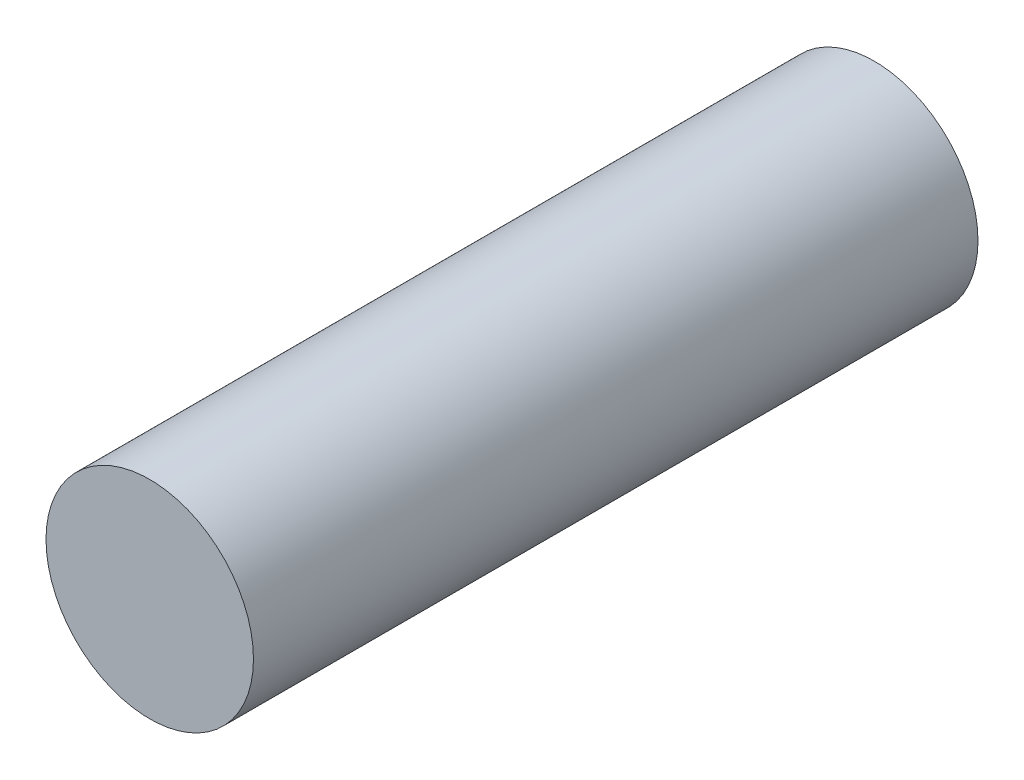
ISO-10303-21;
HEADER;
FILE_DESCRIPTION(('STEP AP214'),'2;1');
FILE_NAME('part.step','',(''),(''),'','','');
FILE_SCHEMA(('AUTOMOTIVE_DESIGN { 1 0 10303 214 1 1 1 1 }'));
ENDSEC;
DATA;
#1=APPLICATION_CONTEXT('core data for automotive mechanical design processes');
#2=APPLICATION_PROTOCOL_DEFINITION('international standard','automotive_design',2000,#1);
#3=PRODUCT_CONTEXT('',#1,'mechanical');
#4=PRODUCT('Part','Part','',(#3));
#5=PRODUCT_RELATED_PRODUCT_CATEGORY('part','',(#4));
#6=PRODUCT_DEFINITION_FORMATION('','',#4);
#7=PRODUCT_DEFINITION_CONTEXT('part definition',#1,'design');
#8=PRODUCT_DEFINITION('design','',#6,#7);
#9=PRODUCT_DEFINITION_SHAPE('','',#8);
#10=(LENGTH_UNIT() NAMED_UNIT(*) SI_UNIT(.MILLI.,.METRE.));
#11=(NAMED_UNIT(*) PLANE_ANGLE_UNIT() SI_UNIT($,.RADIAN.));
#12=(NAMED_UNIT(*) SI_UNIT($,.STERADIAN.) SOLID_ANGLE_UNIT());
#13=UNCERTAINTY_MEASURE_WITH_UNIT(LENGTH_MEASURE(1.E-05),#10,'distance_accuracy_value','');
#14=(GEOMETRIC_REPRESENTATION_CONTEXT(3) GLOBAL_UNCERTAINTY_ASSIGNED_CONTEXT((#13)) GLOBAL_UNIT_ASSIGNED_CONTEXT((#10,
#11,#12)) REPRESENTATION_CONTEXT('',''));
#15=CARTESIAN_POINT('',(0.,0.,0.));
#16=DIRECTION('',(0.,0.,1.));
#17=DIRECTION('',(1.,0.,0.));
#18=AXIS2_PLACEMENT_3D('',#15,#16,#17);
#19=CARTESIAN_POINT('',(0.,0.,117.));
#20=DIRECTION('',(0.,0.,-1.));
#21=DIRECTION('',(-1.,0.,0.));
#22=AXIS2_PLACEMENT_3D('',#19,#20,#21);
#23=CYLINDRICAL_SURFACE('',#22,16.75);
#24=CARTESIAN_POINT('',(0.,0.,117.));
#25=DIRECTION('',(0.,0.,1.));
#26=DIRECTION('',(1.,0.,0.));
#27=AXIS2_PLACEMENT_3D('',#24,#25,#26);
#28=CIRCLE('',#27,16.75);
#29=CARTESIAN_POINT('',(16.75,0.,117.));
#30=VERTEX_POINT('',#29);
#31=EDGE_CURVE('E10',#30,#30,#28,.T.);
#32=ORIENTED_EDGE('',*,*,#31,.F.);
#33=EDGE_LOOP('',(#32));
#34=FACE_BOUND('',#33,.T.);
#35=CARTESIAN_POINT('',(0.,0.,0.));
#36=DIRECTION('',(0.,0.,1.));
#37=DIRECTION('',(1.,0.,0.));
#38=AXIS2_PLACEMENT_3D('',#35,#36,#37);
#39=CIRCLE('',#38,16.75);
#40=CARTESIAN_POINT('',(16.75,0.,0.));
#41=VERTEX_POINT('',#40);
#42=EDGE_CURVE('E37',#41,#41,#39,.T.);
#43=ORIENTED_EDGE('',*,*,#42,.T.);
#44=EDGE_LOOP('',(#43));
#45=FACE_BOUND('',#44,.T.);
#46=ADVANCED_FACE('F34',(#34,#45),#23,.T.);
#47=CARTESIAN_POINT('',(0.,0.,117.));
#48=DIRECTION('',(0.,0.,1.));
#49=DIRECTION('',(1.,0.,0.));
#50=AXIS2_PLACEMENT_3D('',#47,#48,#49);
#51=PLANE('',#50);
#52=ORIENTED_EDGE('',*,*,#31,.T.);
#53=EDGE_LOOP('',(#52));
#54=FACE_BOUND('',#53,.T.);
#55=ADVANCED_FACE('F49',(#54),#51,.T.);
#56=CARTESIAN_POINT('',(0.,0.,0.));
#57=DIRECTION('',(0.,0.,1.));
#58=DIRECTION('',(1.,0.,0.));
#59=AXIS2_PLACEMENT_3D('',#56,#57,#58);
#60=PLANE('',#59);
#61=ORIENTED_EDGE('',*,*,#42,.F.);
#62=EDGE_LOOP('',(#61));
#63=FACE_BOUND('',#62,.T.);
#64=ADVANCED_FACE('F47',(#63),#60,.F.);
#65=CLOSED_SHELL('',(#46,#55,#64));
#66=MANIFOLD_SOLID_BREP('B2',#65);
#67=ADVANCED_BREP_SHAPE_REPRESENTATION('',(#18,#66),#14);
#68=SHAPE_DEFINITION_REPRESENTATION(#9,#67);
ENDSEC;
END-ISO-10303-21;
